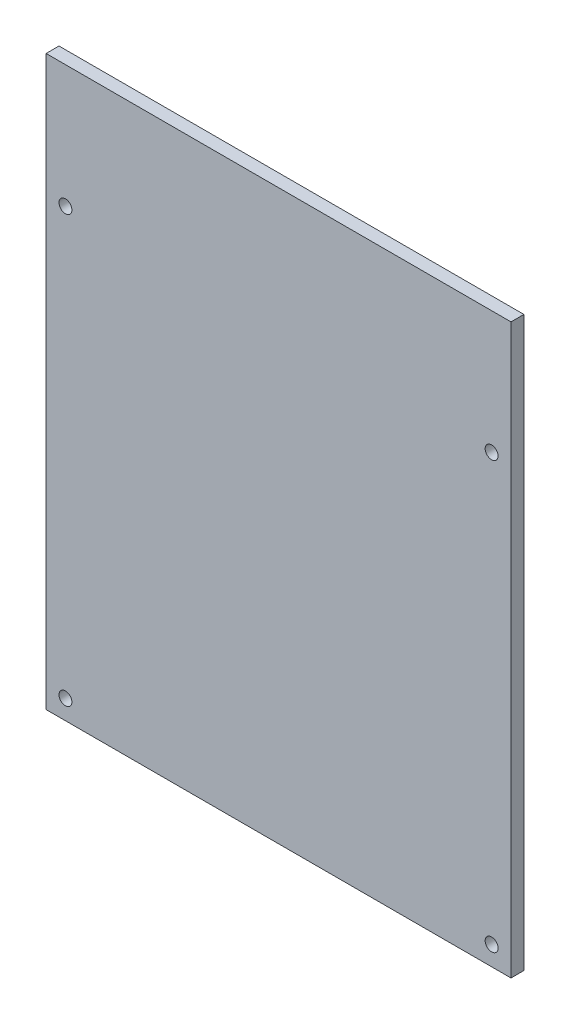
ISO-10303-21;
HEADER;
FILE_DESCRIPTION(('STEP AP214'),'2;1');
FILE_NAME('part.step','',(''),(''),'','','');
FILE_SCHEMA(('AUTOMOTIVE_DESIGN { 1 0 10303 214 1 1 1 1 }'));
ENDSEC;
DATA;
#1=APPLICATION_CONTEXT('core data for automotive mechanical design processes');
#2=APPLICATION_PROTOCOL_DEFINITION('international standard','automotive_design',2000,#1);
#3=PRODUCT_CONTEXT('',#1,'mechanical');
#4=PRODUCT('Part','Part','',(#3));
#5=PRODUCT_RELATED_PRODUCT_CATEGORY('part','',(#4));
#6=PRODUCT_DEFINITION_FORMATION('','',#4);
#7=PRODUCT_DEFINITION_CONTEXT('part definition',#1,'design');
#8=PRODUCT_DEFINITION('design','',#6,#7);
#9=PRODUCT_DEFINITION_SHAPE('','',#8);
#10=(LENGTH_UNIT() NAMED_UNIT(*) SI_UNIT(.MILLI.,.METRE.));
#11=(NAMED_UNIT(*) PLANE_ANGLE_UNIT() SI_UNIT($,.RADIAN.));
#12=(NAMED_UNIT(*) SI_UNIT($,.STERADIAN.) SOLID_ANGLE_UNIT());
#13=UNCERTAINTY_MEASURE_WITH_UNIT(LENGTH_MEASURE(1.E-05),#10,'distance_accuracy_value','');
#14=(GEOMETRIC_REPRESENTATION_CONTEXT(3) GLOBAL_UNCERTAINTY_ASSIGNED_CONTEXT((#13)) GLOBAL_UNIT_ASSIGNED_CONTEXT((#10,
#11,#12)) REPRESENTATION_CONTEXT('',''));
#15=CARTESIAN_POINT('',(0.,0.,0.));
#16=DIRECTION('',(0.,0.,1.));
#17=DIRECTION('',(1.,0.,0.));
#18=AXIS2_PLACEMENT_3D('',#15,#16,#17);
#19=CARTESIAN_POINT('',(0.,0.,12.7));
#20=DIRECTION('',(0.,0.,-1.));
#21=DIRECTION('',(-1.,0.,0.));
#22=AXIS2_PLACEMENT_3D('',#19,#20,#21);
#23=PLANE('',#22);
#24=DIRECTION('',(0.,-1.,0.));
#25=VECTOR('',#24,1.);
#26=CARTESIAN_POINT('',(-213.139130434783,-346.213043478261,12.7));
#27=LINE('',#26,#25);
#28=CARTESIAN_POINT('',(-213.139130434783,212.586956521739,12.7));
#29=VERTEX_POINT('',#28);
#30=CARTESIAN_POINT('',(-213.139130434783,-346.213043478261,12.7));
#31=VERTEX_POINT('',#30);
#32=EDGE_CURVE('E91',#29,#31,#27,.T.);
#33=ORIENTED_EDGE('',*,*,#32,.T.);
#34=DIRECTION('',(1.,0.,0.));
#35=VECTOR('',#34,1.);
#36=CARTESIAN_POINT('',(-213.139130434783,-346.213043478261,12.7));
#37=LINE('',#36,#35);
#38=CARTESIAN_POINT('',(244.060869565217,-346.213043478261,12.7));
#39=VERTEX_POINT('',#38);
#40=EDGE_CURVE('E86',#31,#39,#37,.T.);
#41=ORIENTED_EDGE('',*,*,#40,.T.);
#42=DIRECTION('',(0.,1.,0.));
#43=VECTOR('',#42,1.);
#44=CARTESIAN_POINT('',(244.060869565217,-346.213043478261,12.7));
#45=LINE('',#44,#43);
#46=CARTESIAN_POINT('',(244.060869565217,212.586956521739,12.7));
#47=VERTEX_POINT('',#46);
#48=EDGE_CURVE('E89',#39,#47,#45,.T.);
#49=ORIENTED_EDGE('',*,*,#48,.T.);
#50=DIRECTION('',(-1.,0.,0.));
#51=VECTOR('',#50,1.);
#52=CARTESIAN_POINT('',(-213.139130434783,212.586956521739,12.7));
#53=LINE('',#52,#51);
#54=EDGE_CURVE('E56',#47,#29,#53,.T.);
#55=ORIENTED_EDGE('',*,*,#54,.T.);
#56=EDGE_LOOP('',(#33,#41,#49,#55));
#57=FACE_BOUND('',#56,.T.);
#58=CARTESIAN_POINT('',(-194.089130434783,91.9369565217391,12.7));
#59=DIRECTION('',(0.,0.,1.));
#60=DIRECTION('',(1.,0.,0.));
#61=AXIS2_PLACEMENT_3D('',#58,#59,#60);
#62=CIRCLE('',#61,6.34999999999999);
#63=CARTESIAN_POINT('',(-187.739130434783,91.9369565217391,12.7));
#64=VERTEX_POINT('',#63);
#65=EDGE_CURVE('E111',#64,#64,#62,.T.);
#66=ORIENTED_EDGE('',*,*,#65,.F.);
#67=EDGE_LOOP('',(#66));
#68=FACE_BOUND('',#67,.T.);
#69=CARTESIAN_POINT('',(225.010869565217,91.9369565217391,12.7));
#70=DIRECTION('',(0.,0.,1.));
#71=DIRECTION('',(1.,0.,0.));
#72=AXIS2_PLACEMENT_3D('',#69,#70,#71);
#73=CIRCLE('',#72,6.34999999999999);
#74=CARTESIAN_POINT('',(231.360869565217,91.9369565217391,12.7));
#75=VERTEX_POINT('',#74);
#76=EDGE_CURVE('E133',#75,#75,#73,.T.);
#77=ORIENTED_EDGE('',*,*,#76,.F.);
#78=EDGE_LOOP('',(#77));
#79=FACE_BOUND('',#78,.T.);
#80=CARTESIAN_POINT('',(225.010869565217,-327.163043478261,12.7));
#81=DIRECTION('',(0.,0.,1.));
#82=DIRECTION('',(1.,0.,0.));
#83=AXIS2_PLACEMENT_3D('',#80,#81,#82);
#84=CIRCLE('',#83,6.34999999999999);
#85=CARTESIAN_POINT('',(231.360869565217,-327.163043478261,12.7));
#86=VERTEX_POINT('',#85);
#87=EDGE_CURVE('E141',#86,#86,#84,.T.);
#88=ORIENTED_EDGE('',*,*,#87,.F.);
#89=EDGE_LOOP('',(#88));
#90=FACE_BOUND('',#89,.T.);
#91=CARTESIAN_POINT('',(-194.089130434783,-327.163043478261,12.7));
#92=DIRECTION('',(0.,0.,1.));
#93=DIRECTION('',(1.,0.,0.));
#94=AXIS2_PLACEMENT_3D('',#91,#92,#93);
#95=CIRCLE('',#94,6.34999999999999);
#96=CARTESIAN_POINT('',(-187.739130434783,-327.163043478261,12.7));
#97=VERTEX_POINT('',#96);
#98=EDGE_CURVE('E149',#97,#97,#95,.T.);
#99=ORIENTED_EDGE('',*,*,#98,.F.);
#100=EDGE_LOOP('',(#99));
#101=FACE_BOUND('',#100,.T.);
#102=ADVANCED_FACE('F38',(#57,#68,#79,#90,#101),#23,.F.);
#103=CARTESIAN_POINT('',(0.,0.,0.));
#104=DIRECTION('',(0.,0.,-1.));
#105=DIRECTION('',(-1.,0.,0.));
#106=AXIS2_PLACEMENT_3D('',#103,#104,#105);
#107=PLANE('',#106);
#108=CARTESIAN_POINT('',(225.010869565217,-327.163043478261,0.));
#109=DIRECTION('',(0.,0.,1.));
#110=DIRECTION('',(1.,0.,0.));
#111=AXIS2_PLACEMENT_3D('',#108,#109,#110);
#112=CIRCLE('',#111,6.34999999999999);
#113=CARTESIAN_POINT('',(231.360869565217,-327.163043478261,0.));
#114=VERTEX_POINT('',#113);
#115=EDGE_CURVE('E145',#114,#114,#112,.T.);
#116=ORIENTED_EDGE('',*,*,#115,.T.);
#117=EDGE_LOOP('',(#116));
#118=FACE_BOUND('',#117,.T.);
#119=CARTESIAN_POINT('',(-194.089130434783,91.9369565217391,0.));
#120=DIRECTION('',(0.,0.,1.));
#121=DIRECTION('',(1.,0.,0.));
#122=AXIS2_PLACEMENT_3D('',#119,#120,#121);
#123=CIRCLE('',#122,6.34999999999999);
#124=CARTESIAN_POINT('',(-187.739130434783,91.9369565217391,0.));
#125=VERTEX_POINT('',#124);
#126=EDGE_CURVE('E129',#125,#125,#123,.T.);
#127=ORIENTED_EDGE('',*,*,#126,.T.);
#128=EDGE_LOOP('',(#127));
#129=FACE_BOUND('',#128,.T.);
#130=DIRECTION('',(0.,-1.,0.));
#131=VECTOR('',#130,1.);
#132=CARTESIAN_POINT('',(-213.139130434783,-346.213043478261,0.));
#133=LINE('',#132,#131);
#134=CARTESIAN_POINT('',(-213.139130434783,212.586956521739,0.));
#135=VERTEX_POINT('',#134);
#136=CARTESIAN_POINT('',(-213.139130434783,-346.213043478261,0.));
#137=VERTEX_POINT('',#136);
#138=EDGE_CURVE('E107',#135,#137,#133,.T.);
#139=ORIENTED_EDGE('',*,*,#138,.F.);
#140=DIRECTION('',(-1.,0.,0.));
#141=VECTOR('',#140,1.);
#142=CARTESIAN_POINT('',(-213.139130434783,212.586956521739,0.));
#143=LINE('',#142,#141);
#144=CARTESIAN_POINT('',(244.060869565217,212.586956521739,0.));
#145=VERTEX_POINT('',#144);
#146=EDGE_CURVE('E79',#145,#135,#143,.T.);
#147=ORIENTED_EDGE('',*,*,#146,.F.);
#148=DIRECTION('',(0.,1.,0.));
#149=VECTOR('',#148,1.);
#150=CARTESIAN_POINT('',(244.060869565217,-346.213043478261,0.));
#151=LINE('',#150,#149);
#152=CARTESIAN_POINT('',(244.060869565217,-346.213043478261,0.));
#153=VERTEX_POINT('',#152);
#154=EDGE_CURVE('E73',#153,#145,#151,.T.);
#155=ORIENTED_EDGE('',*,*,#154,.F.);
#156=DIRECTION('',(1.,0.,0.));
#157=VECTOR('',#156,1.);
#158=CARTESIAN_POINT('',(-213.139130434783,-346.213043478261,0.));
#159=LINE('',#158,#157);
#160=EDGE_CURVE('E96',#137,#153,#159,.T.);
#161=ORIENTED_EDGE('',*,*,#160,.F.);
#162=EDGE_LOOP('',(#139,#147,#155,#161));
#163=FACE_BOUND('',#162,.T.);
#164=CARTESIAN_POINT('',(225.010869565217,91.9369565217391,0.));
#165=DIRECTION('',(0.,0.,1.));
#166=DIRECTION('',(1.,0.,0.));
#167=AXIS2_PLACEMENT_3D('',#164,#165,#166);
#168=CIRCLE('',#167,6.34999999999999);
#169=CARTESIAN_POINT('',(231.360869565217,91.9369565217391,0.));
#170=VERTEX_POINT('',#169);
#171=EDGE_CURVE('E137',#170,#170,#168,.T.);
#172=ORIENTED_EDGE('',*,*,#171,.T.);
#173=EDGE_LOOP('',(#172));
#174=FACE_BOUND('',#173,.T.);
#175=CARTESIAN_POINT('',(-194.089130434783,-327.163043478261,0.));
#176=DIRECTION('',(0.,0.,1.));
#177=DIRECTION('',(1.,0.,0.));
#178=AXIS2_PLACEMENT_3D('',#175,#176,#177);
#179=CIRCLE('',#178,6.34999999999999);
#180=CARTESIAN_POINT('',(-187.739130434783,-327.163043478261,0.));
#181=VERTEX_POINT('',#180);
#182=EDGE_CURVE('E153',#181,#181,#179,.T.);
#183=ORIENTED_EDGE('',*,*,#182,.T.);
#184=EDGE_LOOP('',(#183));
#185=FACE_BOUND('',#184,.T.);
#186=ADVANCED_FACE('F124',(#118,#129,#163,#174,#185),#107,.T.);
#187=CARTESIAN_POINT('',(-213.139130434783,-346.213043478261,12.7));
#188=DIRECTION('',(1.,0.,0.));
#189=DIRECTION('',(0.,0.,-1.));
#190=AXIS2_PLACEMENT_3D('',#187,#188,#189);
#191=PLANE('',#190);
#192=ORIENTED_EDGE('',*,*,#138,.T.);
#193=DIRECTION('',(0.,0.,-1.));
#194=VECTOR('',#193,1.);
#195=CARTESIAN_POINT('',(-213.139130434783,-346.213043478261,12.7));
#196=LINE('',#195,#194);
#197=EDGE_CURVE('E11',#31,#137,#196,.T.);
#198=ORIENTED_EDGE('',*,*,#197,.F.);
#199=ORIENTED_EDGE('',*,*,#32,.F.);
#200=DIRECTION('',(0.,0.,-1.));
#201=VECTOR('',#200,1.);
#202=CARTESIAN_POINT('',(-213.139130434783,212.586956521739,12.7));
#203=LINE('',#202,#201);
#204=EDGE_CURVE('E103',#29,#135,#203,.T.);
#205=ORIENTED_EDGE('',*,*,#204,.T.);
#206=EDGE_LOOP('',(#192,#198,#199,#205));
#207=FACE_BOUND('',#206,.T.);
#208=ADVANCED_FACE('F40',(#207),#191,.F.);
#209=CARTESIAN_POINT('',(-213.139130434783,-346.213043478261,12.7));
#210=DIRECTION('',(0.,1.,0.));
#211=DIRECTION('',(0.,0.,1.));
#212=AXIS2_PLACEMENT_3D('',#209,#210,#211);
#213=PLANE('',#212);
#214=ORIENTED_EDGE('',*,*,#160,.T.);
#215=DIRECTION('',(0.,0.,-1.));
#216=VECTOR('',#215,1.);
#217=CARTESIAN_POINT('',(244.060869565217,-346.213043478261,12.7));
#218=LINE('',#217,#216);
#219=EDGE_CURVE('E48',#39,#153,#218,.T.);
#220=ORIENTED_EDGE('',*,*,#219,.F.);
#221=ORIENTED_EDGE('',*,*,#40,.F.);
#222=ORIENTED_EDGE('',*,*,#197,.T.);
#223=EDGE_LOOP('',(#214,#220,#221,#222));
#224=FACE_BOUND('',#223,.T.);
#225=ADVANCED_FACE('F95',(#224),#213,.F.);
#226=CARTESIAN_POINT('',(244.060869565217,-346.213043478261,12.7));
#227=DIRECTION('',(-1.,0.,0.));
#228=DIRECTION('',(0.,0.,1.));
#229=AXIS2_PLACEMENT_3D('',#226,#227,#228);
#230=PLANE('',#229);
#231=ORIENTED_EDGE('',*,*,#154,.T.);
#232=DIRECTION('',(0.,0.,-1.));
#233=VECTOR('',#232,1.);
#234=CARTESIAN_POINT('',(244.060869565217,212.586956521739,12.7));
#235=LINE('',#234,#233);
#236=EDGE_CURVE('E98',#47,#145,#235,.T.);
#237=ORIENTED_EDGE('',*,*,#236,.F.);
#238=ORIENTED_EDGE('',*,*,#48,.F.);
#239=ORIENTED_EDGE('',*,*,#219,.T.);
#240=EDGE_LOOP('',(#231,#237,#238,#239));
#241=FACE_BOUND('',#240,.T.);
#242=ADVANCED_FACE('F99',(#241),#230,.F.);
#243=CARTESIAN_POINT('',(-213.139130434783,212.586956521739,12.7));
#244=DIRECTION('',(0.,-1.,0.));
#245=DIRECTION('',(0.,0.,-1.));
#246=AXIS2_PLACEMENT_3D('',#243,#244,#245);
#247=PLANE('',#246);
#248=ORIENTED_EDGE('',*,*,#146,.T.);
#249=ORIENTED_EDGE('',*,*,#204,.F.);
#250=ORIENTED_EDGE('',*,*,#54,.F.);
#251=ORIENTED_EDGE('',*,*,#236,.T.);
#252=EDGE_LOOP('',(#248,#249,#250,#251));
#253=FACE_BOUND('',#252,.T.);
#254=ADVANCED_FACE('F121',(#253),#247,.F.);
#255=CARTESIAN_POINT('',(-194.089130434783,91.9369565217391,12.7));
#256=DIRECTION('',(0.,0.,-1.));
#257=DIRECTION('',(-1.,0.,0.));
#258=AXIS2_PLACEMENT_3D('',#255,#256,#257);
#259=CYLINDRICAL_SURFACE('',#258,6.34999999999999);
#260=ORIENTED_EDGE('',*,*,#65,.T.);
#261=EDGE_LOOP('',(#260));
#262=FACE_BOUND('',#261,.T.);
#263=ORIENTED_EDGE('',*,*,#126,.F.);
#264=EDGE_LOOP('',(#263));
#265=FACE_BOUND('',#264,.T.);
#266=ADVANCED_FACE('F172',(#262,#265),#259,.F.);
#267=CARTESIAN_POINT('',(225.010869565217,91.9369565217391,12.7));
#268=DIRECTION('',(0.,0.,-1.));
#269=DIRECTION('',(-1.,0.,0.));
#270=AXIS2_PLACEMENT_3D('',#267,#268,#269);
#271=CYLINDRICAL_SURFACE('',#270,6.34999999999999);
#272=ORIENTED_EDGE('',*,*,#76,.T.);
#273=EDGE_LOOP('',(#272));
#274=FACE_BOUND('',#273,.T.);
#275=ORIENTED_EDGE('',*,*,#171,.F.);
#276=EDGE_LOOP('',(#275));
#277=FACE_BOUND('',#276,.T.);
#278=ADVANCED_FACE('F218',(#274,#277),#271,.F.);
#279=CARTESIAN_POINT('',(225.010869565217,-327.163043478261,12.7));
#280=DIRECTION('',(0.,0.,-1.));
#281=DIRECTION('',(-1.,0.,0.));
#282=AXIS2_PLACEMENT_3D('',#279,#280,#281);
#283=CYLINDRICAL_SURFACE('',#282,6.34999999999999);
#284=ORIENTED_EDGE('',*,*,#87,.T.);
#285=EDGE_LOOP('',(#284));
#286=FACE_BOUND('',#285,.T.);
#287=ORIENTED_EDGE('',*,*,#115,.F.);
#288=EDGE_LOOP('',(#287));
#289=FACE_BOUND('',#288,.T.);
#290=ADVANCED_FACE('F226',(#286,#289),#283,.F.);
#291=CARTESIAN_POINT('',(-194.089130434783,-327.163043478261,12.7));
#292=DIRECTION('',(0.,0.,-1.));
#293=DIRECTION('',(-1.,0.,0.));
#294=AXIS2_PLACEMENT_3D('',#291,#292,#293);
#295=CYLINDRICAL_SURFACE('',#294,6.34999999999999);
#296=ORIENTED_EDGE('',*,*,#98,.T.);
#297=EDGE_LOOP('',(#296));
#298=FACE_BOUND('',#297,.T.);
#299=ORIENTED_EDGE('',*,*,#182,.F.);
#300=EDGE_LOOP('',(#299));
#301=FACE_BOUND('',#300,.T.);
#302=ADVANCED_FACE('F161',(#298,#301),#295,.F.);
#303=CLOSED_SHELL('',(#102,#186,#208,#225,#242,#254,#266,#278,#290,#302));
#304=MANIFOLD_SOLID_BREP('B2',#303);
#305=ADVANCED_BREP_SHAPE_REPRESENTATION('',(#18,#304),#14);
#306=SHAPE_DEFINITION_REPRESENTATION(#9,#305);
ENDSEC;
END-ISO-10303-21;
